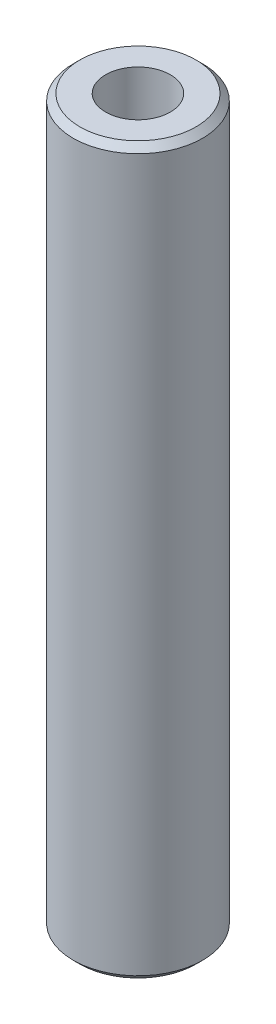
ISO-10303-21;
HEADER;
FILE_DESCRIPTION(('STEP AP214'),'2;1');
FILE_NAME('part.step','',(''),(''),'','','');
FILE_SCHEMA(('AUTOMOTIVE_DESIGN { 1 0 10303 214 1 1 1 1 }'));
ENDSEC;
DATA;
#1=APPLICATION_CONTEXT('core data for automotive mechanical design processes');
#2=APPLICATION_PROTOCOL_DEFINITION('international standard','automotive_design',2000,#1);
#3=PRODUCT_CONTEXT('',#1,'mechanical');
#4=PRODUCT('Part','Part','',(#3));
#5=PRODUCT_RELATED_PRODUCT_CATEGORY('part','',(#4));
#6=PRODUCT_DEFINITION_FORMATION('','',#4);
#7=PRODUCT_DEFINITION_CONTEXT('part definition',#1,'design');
#8=PRODUCT_DEFINITION('design','',#6,#7);
#9=PRODUCT_DEFINITION_SHAPE('','',#8);
#10=(LENGTH_UNIT() NAMED_UNIT(*) SI_UNIT(.MILLI.,.METRE.));
#11=(NAMED_UNIT(*) PLANE_ANGLE_UNIT() SI_UNIT($,.RADIAN.));
#12=(NAMED_UNIT(*) SI_UNIT($,.STERADIAN.) SOLID_ANGLE_UNIT());
#13=UNCERTAINTY_MEASURE_WITH_UNIT(LENGTH_MEASURE(1.E-05),#10,'distance_accuracy_value','');
#14=(GEOMETRIC_REPRESENTATION_CONTEXT(3) GLOBAL_UNCERTAINTY_ASSIGNED_CONTEXT((#13)) GLOBAL_UNIT_ASSIGNED_CONTEXT((#10,
#11,#12)) REPRESENTATION_CONTEXT('',''));
#15=CARTESIAN_POINT('',(0.,0.,0.));
#16=DIRECTION('',(0.,0.,1.));
#17=DIRECTION('',(1.,0.,0.));
#18=AXIS2_PLACEMENT_3D('',#15,#16,#17);
#19=CARTESIAN_POINT('',(0.,280.450265497617,0.));
#20=DIRECTION('',(0.,-1.,0.));
#21=DIRECTION('',(0.,0.,-1.));
#22=AXIS2_PLACEMENT_3D('',#19,#20,#21);
#23=CYLINDRICAL_SURFACE('',#22,25.);
#24=CARTESIAN_POINT('',(0.,277.904466977532,0.));
#25=DIRECTION('',(0.,1.,0.));
#26=DIRECTION('',(0.,0.,1.));
#27=AXIS2_PLACEMENT_3D('',#24,#25,#26);
#28=CIRCLE('',#27,25.);
#29=CARTESIAN_POINT('',(0.,277.904466977532,25.));
#30=VERTEX_POINT('',#29);
#31=EDGE_CURVE('E50',#30,#30,#28,.F.);
#32=ORIENTED_EDGE('',*,*,#31,.T.);
#33=EDGE_LOOP('',(#32));
#34=FACE_BOUND('',#33,.T.);
#35=CARTESIAN_POINT('',(0.,2.54579852008474,0.));
#36=DIRECTION('',(0.,1.,0.));
#37=DIRECTION('',(0.,0.,1.));
#38=AXIS2_PLACEMENT_3D('',#35,#36,#37);
#39=CIRCLE('',#38,25.);
#40=CARTESIAN_POINT('',(0.,2.54579852008474,25.));
#41=VERTEX_POINT('',#40);
#42=EDGE_CURVE('E51',#41,#41,#39,.T.);
#43=ORIENTED_EDGE('',*,*,#42,.T.);
#44=EDGE_LOOP('',(#43));
#45=FACE_BOUND('',#44,.T.);
#46=ADVANCED_FACE('F39',(#34,#45),#23,.T.);
#47=CARTESIAN_POINT('',(0.,280.450265497617,0.));
#48=DIRECTION('',(0.,1.,0.));
#49=DIRECTION('',(0.,0.,1.));
#50=AXIS2_PLACEMENT_3D('',#47,#48,#49);
#51=PLANE('',#50);
#52=CARTESIAN_POINT('',(0.,280.450265497617,0.));
#53=DIRECTION('',(0.,1.,0.));
#54=DIRECTION('',(0.,0.,1.));
#55=AXIS2_PLACEMENT_3D('',#52,#53,#54);
#56=CIRCLE('',#55,22.4542014799153);
#57=CARTESIAN_POINT('',(0.,280.450265497617,22.4542014799153));
#58=VERTEX_POINT('',#57);
#59=EDGE_CURVE('E54',#58,#58,#56,.T.);
#60=ORIENTED_EDGE('',*,*,#59,.T.);
#61=EDGE_LOOP('',(#60));
#62=FACE_BOUND('',#61,.T.);
#63=CARTESIAN_POINT('',(0.,280.450265497617,0.));
#64=DIRECTION('',(0.,1.,0.));
#65=DIRECTION('',(0.,0.,1.));
#66=AXIS2_PLACEMENT_3D('',#63,#64,#65);
#67=CIRCLE('',#66,12.5253323432419);
#68=CARTESIAN_POINT('',(0.,280.450265497617,12.5253323432419));
#69=VERTEX_POINT('',#68);
#70=EDGE_CURVE('E58',#69,#69,#67,.T.);
#71=ORIENTED_EDGE('',*,*,#70,.F.);
#72=EDGE_LOOP('',(#71));
#73=FACE_BOUND('',#72,.T.);
#74=ADVANCED_FACE('F69',(#62,#73),#51,.T.);
#75=CARTESIAN_POINT('',(0.,0.,0.));
#76=DIRECTION('',(0.,1.,0.));
#77=DIRECTION('',(0.,0.,1.));
#78=AXIS2_PLACEMENT_3D('',#75,#76,#77);
#79=PLANE('',#78);
#80=CARTESIAN_POINT('',(0.,0.,0.));
#81=DIRECTION('',(0.,1.,0.));
#82=DIRECTION('',(0.,0.,1.));
#83=AXIS2_PLACEMENT_3D('',#80,#81,#82);
#84=CIRCLE('',#83,22.4542014799152);
#85=CARTESIAN_POINT('',(0.,0.,22.4542014799152));
#86=VERTEX_POINT('',#85);
#87=EDGE_CURVE('E10',#86,#86,#84,.F.);
#88=ORIENTED_EDGE('',*,*,#87,.T.);
#89=EDGE_LOOP('',(#88));
#90=FACE_BOUND('',#89,.T.);
#91=CARTESIAN_POINT('',(0.,0.,0.));
#92=DIRECTION('',(0.,1.,0.));
#93=DIRECTION('',(0.,0.,1.));
#94=AXIS2_PLACEMENT_3D('',#91,#92,#93);
#95=CIRCLE('',#94,12.5253323432419);
#96=CARTESIAN_POINT('',(0.,0.,12.5253323432419));
#97=VERTEX_POINT('',#96);
#98=EDGE_CURVE('E63',#97,#97,#95,.T.);
#99=ORIENTED_EDGE('',*,*,#98,.T.);
#100=EDGE_LOOP('',(#99));
#101=FACE_BOUND('',#100,.T.);
#102=ADVANCED_FACE('F75',(#90,#101),#79,.F.);
#103=CARTESIAN_POINT('',(0.,280.450265497617,0.));
#104=DIRECTION('',(0.,-1.,0.));
#105=DIRECTION('',(0.,0.,-1.));
#106=AXIS2_PLACEMENT_3D('',#103,#104,#105);
#107=CYLINDRICAL_SURFACE('',#106,12.5253323432419);
#108=ORIENTED_EDGE('',*,*,#70,.T.);
#109=EDGE_LOOP('',(#108));
#110=FACE_BOUND('',#109,.T.);
#111=ORIENTED_EDGE('',*,*,#98,.F.);
#112=EDGE_LOOP('',(#111));
#113=FACE_BOUND('',#112,.T.);
#114=ADVANCED_FACE('F70',(#110,#113),#107,.F.);
#115=CARTESIAN_POINT('',(0.,280.450265497617,0.));
#116=DIRECTION('',(0.,-1.,0.));
#117=DIRECTION('',(0.,0.,-1.));
#118=AXIS2_PLACEMENT_3D('',#115,#116,#117);
#119=CONICAL_SURFACE('',#118,22.4542014799153,0.78539816339745);
#120=ORIENTED_EDGE('',*,*,#31,.F.);
#121=EDGE_LOOP('',(#120));
#122=FACE_BOUND('',#121,.T.);
#123=ORIENTED_EDGE('',*,*,#59,.F.);
#124=EDGE_LOOP('',(#123));
#125=FACE_BOUND('',#124,.T.);
#126=ADVANCED_FACE('F81',(#122,#125),#119,.T.);
#127=CARTESIAN_POINT('',(0.,2.54579852008474,0.));
#128=DIRECTION('',(0.,1.,0.));
#129=DIRECTION('',(0.,0.,1.));
#130=AXIS2_PLACEMENT_3D('',#127,#128,#129);
#131=CONICAL_SURFACE('',#130,25.,0.785398163397454);
#132=ORIENTED_EDGE('',*,*,#87,.F.);
#133=EDGE_LOOP('',(#132));
#134=FACE_BOUND('',#133,.T.);
#135=ORIENTED_EDGE('',*,*,#42,.F.);
#136=EDGE_LOOP('',(#135));
#137=FACE_BOUND('',#136,.T.);
#138=ADVANCED_FACE('F45',(#134,#137),#131,.T.);
#139=CLOSED_SHELL('',(#46,#74,#102,#114,#126,#138));
#140=MANIFOLD_SOLID_BREP('B2',#139);
#141=ADVANCED_BREP_SHAPE_REPRESENTATION('',(#18,#140),#14);
#142=SHAPE_DEFINITION_REPRESENTATION(#9,#141);
ENDSEC;
END-ISO-10303-21;
